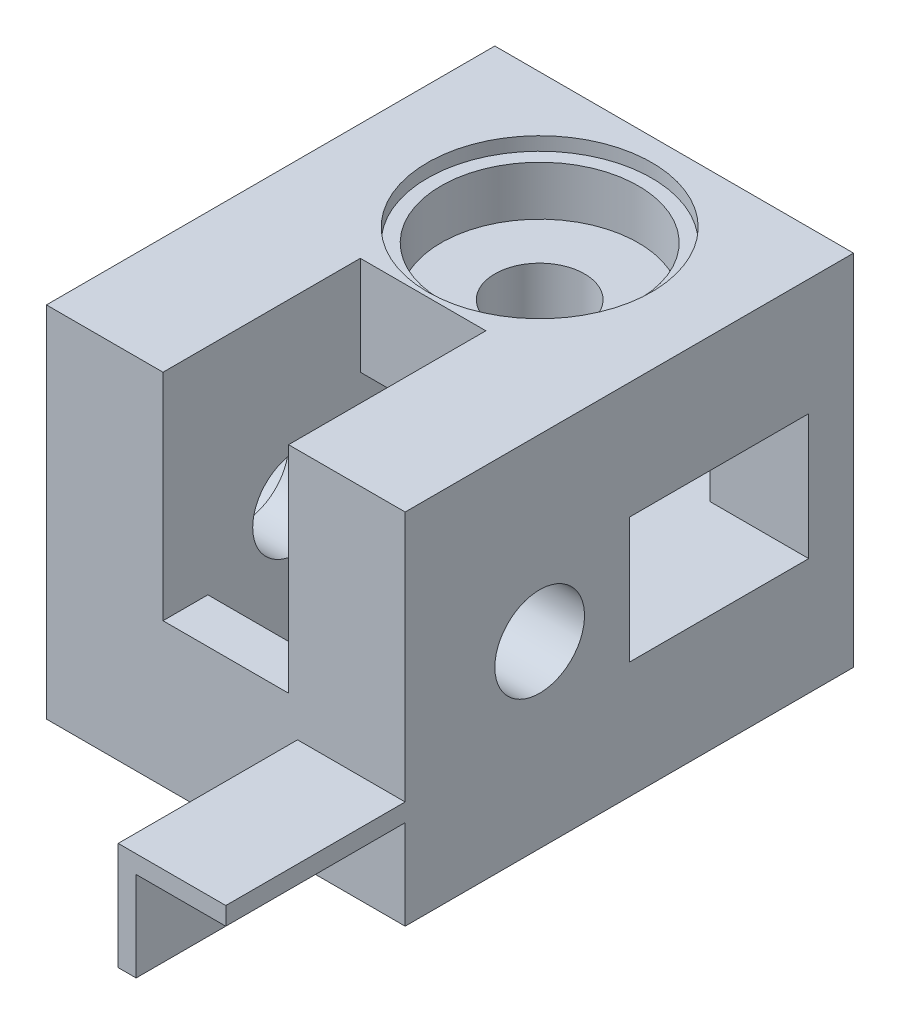
ISO-10303-21;
HEADER;
FILE_DESCRIPTION(('STEP AP214'),'2;1');
FILE_NAME('part.step','',(''),(''),'','','');
FILE_SCHEMA(('AUTOMOTIVE_DESIGN { 1 0 10303 214 1 1 1 1 }'));
ENDSEC;
DATA;
#1=APPLICATION_CONTEXT('core data for automotive mechanical design processes');
#2=APPLICATION_PROTOCOL_DEFINITION('international standard','automotive_design',2000,#1);
#3=PRODUCT_CONTEXT('',#1,'mechanical');
#4=PRODUCT('Part','Part','',(#3));
#5=PRODUCT_RELATED_PRODUCT_CATEGORY('part','',(#4));
#6=PRODUCT_DEFINITION_FORMATION('','',#4);
#7=PRODUCT_DEFINITION_CONTEXT('part definition',#1,'design');
#8=PRODUCT_DEFINITION('design','',#6,#7);
#9=PRODUCT_DEFINITION_SHAPE('','',#8);
#10=(LENGTH_UNIT() NAMED_UNIT(*) SI_UNIT(.MILLI.,.METRE.));
#11=(NAMED_UNIT(*) PLANE_ANGLE_UNIT() SI_UNIT($,.RADIAN.));
#12=(NAMED_UNIT(*) SI_UNIT($,.STERADIAN.) SOLID_ANGLE_UNIT());
#13=UNCERTAINTY_MEASURE_WITH_UNIT(LENGTH_MEASURE(1.E-05),#10,'distance_accuracy_value','');
#14=(GEOMETRIC_REPRESENTATION_CONTEXT(3) GLOBAL_UNCERTAINTY_ASSIGNED_CONTEXT((#13)) GLOBAL_UNIT_ASSIGNED_CONTEXT((#10,
#11,#12)) REPRESENTATION_CONTEXT('',''));
#15=CARTESIAN_POINT('',(0.,0.,0.));
#16=DIRECTION('',(0.,0.,1.));
#17=DIRECTION('',(1.,0.,0.));
#18=AXIS2_PLACEMENT_3D('',#15,#16,#17);
#19=CARTESIAN_POINT('',(-33.,20.,35.));
#20=DIRECTION('',(-1.,0.,0.));
#21=DIRECTION('',(0.,0.,1.));
#22=AXIS2_PLACEMENT_3D('',#19,#20,#21);
#23=CYLINDRICAL_SURFACE('',#22,11.);
#24=CARTESIAN_POINT('',(-33.,20.,35.));
#25=DIRECTION('',(-1.,0.,0.));
#26=DIRECTION('',(0.,0.,1.));
#27=AXIS2_PLACEMENT_3D('',#24,#25,#26);
#28=CIRCLE('',#27,11.);
#29=CARTESIAN_POINT('',(-33.,20.,46.));
#30=VERTEX_POINT('',#29);
#31=EDGE_CURVE('E463',#30,#30,#28,.T.);
#32=ORIENTED_EDGE('',*,*,#31,.F.);
#33=EDGE_LOOP('',(#32));
#34=FACE_BOUND('',#33,.T.);
#35=CARTESIAN_POINT('',(-38.5,20.,35.));
#36=DIRECTION('',(-1.,0.,0.));
#37=DIRECTION('',(0.,0.,1.));
#38=AXIS2_PLACEMENT_3D('',#35,#36,#37);
#39=CIRCLE('',#38,11.);
#40=CARTESIAN_POINT('',(-38.5,20.,46.));
#41=VERTEX_POINT('',#40);
#42=EDGE_CURVE('E37',#41,#41,#39,.F.);
#43=ORIENTED_EDGE('',*,*,#42,.F.);
#44=EDGE_LOOP('',(#43));
#45=FACE_BOUND('',#44,.T.);
#46=ADVANCED_FACE('F33',(#34,#45),#23,.F.);
#47=CARTESIAN_POINT('',(0.,20.,35.));
#48=DIRECTION('',(-1.,0.,0.));
#49=DIRECTION('',(0.,0.,1.));
#50=AXIS2_PLACEMENT_3D('',#47,#48,#49);
#51=CYLINDRICAL_SURFACE('',#50,5.);
#52=CARTESIAN_POINT('',(-27.,20.,35.));
#53=DIRECTION('',(-1.,0.,0.));
#54=DIRECTION('',(0.,0.,1.));
#55=AXIS2_PLACEMENT_3D('',#52,#53,#54);
#56=CIRCLE('',#55,5.);
#57=CARTESIAN_POINT('',(-27.,20.,40.));
#58=VERTEX_POINT('',#57);
#59=EDGE_CURVE('E353',#58,#58,#56,.F.);
#60=ORIENTED_EDGE('',*,*,#59,.T.);
#61=EDGE_LOOP('',(#60));
#62=FACE_BOUND('',#61,.T.);
#63=CARTESIAN_POINT('',(-33.,20.,35.));
#64=DIRECTION('',(-1.,0.,0.));
#65=DIRECTION('',(0.,0.,1.));
#66=AXIS2_PLACEMENT_3D('',#63,#64,#65);
#67=CIRCLE('',#66,5.);
#68=CARTESIAN_POINT('',(-33.,20.,40.));
#69=VERTEX_POINT('',#68);
#70=EDGE_CURVE('E460',#69,#69,#67,.F.);
#71=ORIENTED_EDGE('',*,*,#70,.F.);
#72=EDGE_LOOP('',(#71));
#73=FACE_BOUND('',#72,.T.);
#74=ADVANCED_FACE('F506',(#62,#73),#51,.F.);
#75=CARTESIAN_POINT('',(0.,0.,50.));
#76=DIRECTION('',(0.,0.,1.));
#77=DIRECTION('',(1.,0.,0.));
#78=AXIS2_PLACEMENT_3D('',#75,#76,#77);
#79=PLANE('',#78);
#80=DIRECTION('',(0.,-1.,0.));
#81=VECTOR('',#80,1.);
#82=CARTESIAN_POINT('',(-12.,12.,50.));
#83=LINE('',#82,#81);
#84=CARTESIAN_POINT('',(-12.,12.,50.));
#85=VERTEX_POINT('',#84);
#86=CARTESIAN_POINT('',(-12.,0.,50.));
#87=VERTEX_POINT('',#86);
#88=EDGE_CURVE('E50',#85,#87,#83,.T.);
#89=ORIENTED_EDGE('',*,*,#88,.F.);
#90=DIRECTION('',(-1.,0.,0.));
#91=VECTOR('',#90,1.);
#92=CARTESIAN_POINT('',(0.,12.,50.));
#93=LINE('',#92,#91);
#94=CARTESIAN_POINT('',(0.,12.,50.));
#95=VERTEX_POINT('',#94);
#96=EDGE_CURVE('E54',#95,#85,#93,.T.);
#97=ORIENTED_EDGE('',*,*,#96,.F.);
#98=DIRECTION('',(0.,1.,0.));
#99=VECTOR('',#98,1.);
#100=CARTESIAN_POINT('',(0.,40.,50.));
#101=LINE('',#100,#99);
#102=CARTESIAN_POINT('',(0.,40.,50.));
#103=VERTEX_POINT('',#102);
#104=EDGE_CURVE('E409',#95,#103,#101,.T.);
#105=ORIENTED_EDGE('',*,*,#104,.T.);
#106=DIRECTION('',(-1.,0.,0.));
#107=VECTOR('',#106,1.);
#108=CARTESIAN_POINT('',(-40.,40.,50.));
#109=LINE('',#108,#107);
#110=CARTESIAN_POINT('',(-13.,40.,50.));
#111=VERTEX_POINT('',#110);
#112=EDGE_CURVE('E439',#103,#111,#109,.T.);
#113=ORIENTED_EDGE('',*,*,#112,.T.);
#114=DIRECTION('',(0.,1.,0.));
#115=VECTOR('',#114,1.);
#116=CARTESIAN_POINT('',(-13.,16.,50.));
#117=LINE('',#116,#115);
#118=CARTESIAN_POINT('',(-13.,16.,50.));
#119=VERTEX_POINT('',#118);
#120=EDGE_CURVE('E292',#119,#111,#117,.T.);
#121=ORIENTED_EDGE('',*,*,#120,.F.);
#122=DIRECTION('',(1.,0.,0.));
#123=VECTOR('',#122,1.);
#124=CARTESIAN_POINT('',(-27.,16.,50.));
#125=LINE('',#124,#123);
#126=CARTESIAN_POINT('',(-27.,16.,50.));
#127=VERTEX_POINT('',#126);
#128=EDGE_CURVE('E273',#127,#119,#125,.T.);
#129=ORIENTED_EDGE('',*,*,#128,.F.);
#130=DIRECTION('',(0.,1.,0.));
#131=VECTOR('',#130,1.);
#132=CARTESIAN_POINT('',(-27.,16.,50.));
#133=LINE('',#132,#131);
#134=CARTESIAN_POINT('',(-27.,40.,50.));
#135=VERTEX_POINT('',#134);
#136=EDGE_CURVE('E279',#127,#135,#133,.T.);
#137=ORIENTED_EDGE('',*,*,#136,.T.);
#138=CARTESIAN_POINT('',(-40.,40.,50.));
#139=VERTEX_POINT('',#138);
#140=EDGE_CURVE('E448',#135,#139,#109,.T.);
#141=ORIENTED_EDGE('',*,*,#140,.T.);
#142=DIRECTION('',(0.,-1.,0.));
#143=VECTOR('',#142,1.);
#144=CARTESIAN_POINT('',(-40.,40.,50.));
#145=LINE('',#144,#143);
#146=CARTESIAN_POINT('',(-40.,0.,50.));
#147=VERTEX_POINT('',#146);
#148=EDGE_CURVE('E395',#139,#147,#145,.T.);
#149=ORIENTED_EDGE('',*,*,#148,.T.);
#150=DIRECTION('',(1.,0.,0.));
#151=VECTOR('',#150,1.);
#152=CARTESIAN_POINT('',(-40.,0.,50.));
#153=LINE('',#152,#151);
#154=EDGE_CURVE('E407',#147,#87,#153,.T.);
#155=ORIENTED_EDGE('',*,*,#154,.T.);
#156=EDGE_LOOP('',(#89,#97,#105,#113,#121,#129,#137,#141,#149,#155));
#157=FACE_BOUND('',#156,.T.);
#158=ADVANCED_FACE('F513',(#157),#79,.T.);
#159=CARTESIAN_POINT('',(-20.,33.,15.));
#160=DIRECTION('',(0.,1.,0.));
#161=DIRECTION('',(0.,0.,1.));
#162=AXIS2_PLACEMENT_3D('',#159,#160,#161);
#163=CYLINDRICAL_SURFACE('',#162,11.);
#164=CARTESIAN_POINT('',(-20.,33.,15.));
#165=DIRECTION('',(0.,1.,0.));
#166=DIRECTION('',(0.,0.,1.));
#167=AXIS2_PLACEMENT_3D('',#164,#165,#166);
#168=CIRCLE('',#167,11.);
#169=CARTESIAN_POINT('',(-20.,33.,26.));
#170=VERTEX_POINT('',#169);
#171=EDGE_CURVE('E266',#170,#170,#168,.T.);
#172=ORIENTED_EDGE('',*,*,#171,.F.);
#173=EDGE_LOOP('',(#172));
#174=FACE_BOUND('',#173,.T.);
#175=CARTESIAN_POINT('',(-20.,38.5,15.));
#176=DIRECTION('',(0.,1.,0.));
#177=DIRECTION('',(0.,0.,1.));
#178=AXIS2_PLACEMENT_3D('',#175,#176,#177);
#179=CIRCLE('',#178,11.);
#180=CARTESIAN_POINT('',(-20.,38.5,26.));
#181=VERTEX_POINT('',#180);
#182=EDGE_CURVE('E264',#181,#181,#179,.F.);
#183=ORIENTED_EDGE('',*,*,#182,.F.);
#184=EDGE_LOOP('',(#183));
#185=FACE_BOUND('',#184,.T.);
#186=ADVANCED_FACE('F547',(#174,#185),#163,.F.);
#187=CARTESIAN_POINT('',(-20.,0.,15.));
#188=DIRECTION('',(0.,1.,0.));
#189=DIRECTION('',(0.,0.,1.));
#190=AXIS2_PLACEMENT_3D('',#187,#188,#189);
#191=CYLINDRICAL_SURFACE('',#190,5.);
#192=CARTESIAN_POINT('',(-20.,27.,15.));
#193=DIRECTION('',(0.,1.,0.));
#194=DIRECTION('',(0.,0.,1.));
#195=AXIS2_PLACEMENT_3D('',#192,#193,#194);
#196=CIRCLE('',#195,5.);
#197=CARTESIAN_POINT('',(-20.,27.,20.));
#198=VERTEX_POINT('',#197);
#199=EDGE_CURVE('E380',#198,#198,#196,.F.);
#200=ORIENTED_EDGE('',*,*,#199,.T.);
#201=EDGE_LOOP('',(#200));
#202=FACE_BOUND('',#201,.T.);
#203=CARTESIAN_POINT('',(-20.,33.,15.));
#204=DIRECTION('',(0.,1.,0.));
#205=DIRECTION('',(0.,0.,1.));
#206=AXIS2_PLACEMENT_3D('',#203,#204,#205);
#207=CIRCLE('',#206,5.);
#208=CARTESIAN_POINT('',(-20.,33.,20.));
#209=VERTEX_POINT('',#208);
#210=EDGE_CURVE('E269',#209,#209,#207,.F.);
#211=ORIENTED_EDGE('',*,*,#210,.F.);
#212=EDGE_LOOP('',(#211));
#213=FACE_BOUND('',#212,.T.);
#214=ADVANCED_FACE('F550',(#202,#213),#191,.F.);
#215=CARTESIAN_POINT('',(-13.,20.,35.));
#216=DIRECTION('',(1.,0.,0.));
#217=DIRECTION('',(0.,0.,-1.));
#218=AXIS2_PLACEMENT_3D('',#215,#216,#217);
#219=CIRCLE('',#218,5.);
#220=CARTESIAN_POINT('',(-13.,20.,30.));
#221=VERTEX_POINT('',#220);
#222=EDGE_CURVE('E374',#221,#221,#219,.F.);
#223=ORIENTED_EDGE('',*,*,#222,.T.);
#224=EDGE_LOOP('',(#223));
#225=FACE_BOUND('',#224,.T.);
#226=CARTESIAN_POINT('',(0.,20.,35.));
#227=DIRECTION('',(-1.,0.,0.));
#228=DIRECTION('',(0.,0.,1.));
#229=AXIS2_PLACEMENT_3D('',#226,#227,#228);
#230=CIRCLE('',#229,5.);
#231=CARTESIAN_POINT('',(0.,20.,40.));
#232=VERTEX_POINT('',#231);
#233=EDGE_CURVE('E387',#232,#232,#230,.T.);
#234=ORIENTED_EDGE('',*,*,#233,.F.);
#235=EDGE_LOOP('',(#234));
#236=FACE_BOUND('',#235,.T.);
#237=ADVANCED_FACE('F516',(#225,#236),#51,.F.);
#238=CARTESIAN_POINT('',(-20.,13.,15.));
#239=DIRECTION('',(0.,-1.,0.));
#240=DIRECTION('',(0.,0.,-1.));
#241=AXIS2_PLACEMENT_3D('',#238,#239,#240);
#242=CIRCLE('',#241,5.);
#243=CARTESIAN_POINT('',(-20.,13.,10.));
#244=VERTEX_POINT('',#243);
#245=EDGE_CURVE('E391',#244,#244,#242,.F.);
#246=ORIENTED_EDGE('',*,*,#245,.T.);
#247=EDGE_LOOP('',(#246));
#248=FACE_BOUND('',#247,.T.);
#249=CARTESIAN_POINT('',(-20.,0.,15.));
#250=DIRECTION('',(0.,1.,0.));
#251=DIRECTION('',(0.,0.,1.));
#252=AXIS2_PLACEMENT_3D('',#249,#250,#251);
#253=CIRCLE('',#252,5.);
#254=CARTESIAN_POINT('',(-20.,0.,20.));
#255=VERTEX_POINT('',#254);
#256=EDGE_CURVE('E390',#255,#255,#253,.T.);
#257=ORIENTED_EDGE('',*,*,#256,.F.);
#258=EDGE_LOOP('',(#257));
#259=FACE_BOUND('',#258,.T.);
#260=ADVANCED_FACE('F611',(#248,#259),#191,.F.);
#261=CARTESIAN_POINT('',(-40.,40.,50.));
#262=DIRECTION('',(1.,0.,0.));
#263=DIRECTION('',(0.,0.,-1.));
#264=AXIS2_PLACEMENT_3D('',#261,#262,#263);
#265=PLANE('',#264);
#266=CARTESIAN_POINT('',(-40.,20.,35.));
#267=DIRECTION('',(-1.,0.,0.));
#268=DIRECTION('',(0.,0.,1.));
#269=AXIS2_PLACEMENT_3D('',#266,#267,#268);
#270=CIRCLE('',#269,12.5);
#271=CARTESIAN_POINT('',(-40.,20.,47.5));
#272=VERTEX_POINT('',#271);
#273=EDGE_CURVE('E493',#272,#272,#270,.T.);
#274=ORIENTED_EDGE('',*,*,#273,.F.);
#275=EDGE_LOOP('',(#274));
#276=FACE_BOUND('',#275,.T.);
#277=DIRECTION('',(0.,1.,0.));
#278=VECTOR('',#277,1.);
#279=CARTESIAN_POINT('',(-40.,27.,22.));
#280=LINE('',#279,#278);
#281=CARTESIAN_POINT('',(-40.,13.,22.));
#282=VERTEX_POINT('',#281);
#283=CARTESIAN_POINT('',(-40.,27.,22.));
#284=VERTEX_POINT('',#283);
#285=EDGE_CURVE('E370',#282,#284,#280,.T.);
#286=ORIENTED_EDGE('',*,*,#285,.F.);
#287=DIRECTION('',(0.,0.,1.));
#288=VECTOR('',#287,1.);
#289=CARTESIAN_POINT('',(-40.,13.,22.));
#290=LINE('',#289,#288);
#291=CARTESIAN_POINT('',(-40.,13.,0.));
#292=VERTEX_POINT('',#291);
#293=EDGE_CURVE('E364',#292,#282,#290,.T.);
#294=ORIENTED_EDGE('',*,*,#293,.F.);
#295=DIRECTION('',(0.,-1.,0.));
#296=VECTOR('',#295,1.);
#297=CARTESIAN_POINT('',(-40.,40.,0.));
#298=LINE('',#297,#296);
#299=CARTESIAN_POINT('',(-40.,0.,0.));
#300=VERTEX_POINT('',#299);
#301=EDGE_CURVE('E394',#292,#300,#298,.T.);
#302=ORIENTED_EDGE('',*,*,#301,.T.);
#303=DIRECTION('',(0.,0.,-1.));
#304=VECTOR('',#303,1.);
#305=CARTESIAN_POINT('',(-40.,0.,50.));
#306=LINE('',#305,#304);
#307=EDGE_CURVE('E419',#147,#300,#306,.T.);
#308=ORIENTED_EDGE('',*,*,#307,.F.);
#309=ORIENTED_EDGE('',*,*,#148,.F.);
#310=DIRECTION('',(0.,0.,-1.));
#311=VECTOR('',#310,1.);
#312=CARTESIAN_POINT('',(-40.,40.,50.));
#313=LINE('',#312,#311);
#314=CARTESIAN_POINT('',(-40.,40.,0.));
#315=VERTEX_POINT('',#314);
#316=EDGE_CURVE('E436',#139,#315,#313,.T.);
#317=ORIENTED_EDGE('',*,*,#316,.T.);
#318=CARTESIAN_POINT('',(-40.,27.,0.));
#319=VERTEX_POINT('',#318);
#320=EDGE_CURVE('E445',#315,#319,#298,.T.);
#321=ORIENTED_EDGE('',*,*,#320,.T.);
#322=DIRECTION('',(0.,0.,-1.));
#323=VECTOR('',#322,1.);
#324=CARTESIAN_POINT('',(-40.,27.,22.));
#325=LINE('',#324,#323);
#326=EDGE_CURVE('E373',#284,#319,#325,.T.);
#327=ORIENTED_EDGE('',*,*,#326,.F.);
#328=EDGE_LOOP('',(#286,#294,#302,#308,#309,#317,#321,#327));
#329=FACE_BOUND('',#328,.T.);
#330=ADVANCED_FACE('F35',(#276,#329),#265,.F.);
#331=CARTESIAN_POINT('',(-40.,0.,50.));
#332=DIRECTION('',(0.,1.,0.));
#333=DIRECTION('',(0.,0.,1.));
#334=AXIS2_PLACEMENT_3D('',#331,#332,#333);
#335=PLANE('',#334);
#336=DIRECTION('',(-1.,0.,0.));
#337=VECTOR('',#336,1.);
#338=CARTESIAN_POINT('',(-13.,0.,45.));
#339=LINE('',#338,#337);
#340=CARTESIAN_POINT('',(-13.,0.,45.));
#341=VERTEX_POINT('',#340);
#342=CARTESIAN_POINT('',(-27.,0.,45.));
#343=VERTEX_POINT('',#342);
#344=EDGE_CURVE('E342',#341,#343,#339,.T.);
#345=ORIENTED_EDGE('',*,*,#344,.F.);
#346=DIRECTION('',(0.,0.,1.));
#347=VECTOR('',#346,1.);
#348=CARTESIAN_POINT('',(-13.,0.,25.));
#349=LINE('',#348,#347);
#350=CARTESIAN_POINT('',(-13.,0.,25.));
#351=VERTEX_POINT('',#350);
#352=EDGE_CURVE('E329',#351,#341,#349,.T.);
#353=ORIENTED_EDGE('',*,*,#352,.F.);
#354=DIRECTION('',(1.,0.,0.));
#355=VECTOR('',#354,1.);
#356=CARTESIAN_POINT('',(-13.,0.,25.));
#357=LINE('',#356,#355);
#358=CARTESIAN_POINT('',(-27.,0.,25.));
#359=VERTEX_POINT('',#358);
#360=EDGE_CURVE('E334',#359,#351,#357,.T.);
#361=ORIENTED_EDGE('',*,*,#360,.F.);
#362=DIRECTION('',(0.,0.,-1.));
#363=VECTOR('',#362,1.);
#364=CARTESIAN_POINT('',(-27.,0.,25.));
#365=LINE('',#364,#363);
#366=EDGE_CURVE('E345',#343,#359,#365,.T.);
#367=ORIENTED_EDGE('',*,*,#366,.F.);
#368=EDGE_LOOP('',(#345,#353,#361,#367));
#369=FACE_BOUND('',#368,.T.);
#370=ORIENTED_EDGE('',*,*,#256,.T.);
#371=EDGE_LOOP('',(#370));
#372=FACE_BOUND('',#371,.T.);
#373=DIRECTION('',(1.,0.,0.));
#374=VECTOR('',#373,1.);
#375=CARTESIAN_POINT('',(-40.,0.,0.));
#376=LINE('',#375,#374);
#377=CARTESIAN_POINT('',(0.,0.,0.));
#378=VERTEX_POINT('',#377);
#379=EDGE_CURVE('E443',#300,#378,#376,.T.);
#380=ORIENTED_EDGE('',*,*,#379,.T.);
#381=DIRECTION('',(0.,0.,-1.));
#382=VECTOR('',#381,1.);
#383=CARTESIAN_POINT('',(0.,0.,50.));
#384=LINE('',#383,#382);
#385=CARTESIAN_POINT('',(0.,0.,50.));
#386=VERTEX_POINT('',#385);
#387=EDGE_CURVE('E430',#386,#378,#384,.T.);
#388=ORIENTED_EDGE('',*,*,#387,.F.);
#389=CARTESIAN_POINT('',(-10.,0.,50.));
#390=VERTEX_POINT('',#389);
#391=EDGE_CURVE('E236',#390,#386,#153,.T.);
#392=ORIENTED_EDGE('',*,*,#391,.F.);
#393=DIRECTION('',(0.,0.,-1.));
#394=VECTOR('',#393,1.);
#395=CARTESIAN_POINT('',(-10.,0.,70.));
#396=LINE('',#395,#394);
#397=CARTESIAN_POINT('',(-10.,0.,70.));
#398=VERTEX_POINT('',#397);
#399=EDGE_CURVE('E217',#398,#390,#396,.T.);
#400=ORIENTED_EDGE('',*,*,#399,.F.);
#401=DIRECTION('',(1.,0.,0.));
#402=VECTOR('',#401,1.);
#403=CARTESIAN_POINT('',(-12.,0.,70.));
#404=LINE('',#403,#402);
#405=CARTESIAN_POINT('',(-12.,0.,70.));
#406=VERTEX_POINT('',#405);
#407=EDGE_CURVE('E223',#406,#398,#404,.T.);
#408=ORIENTED_EDGE('',*,*,#407,.F.);
#409=DIRECTION('',(0.,0.,-1.));
#410=VECTOR('',#409,1.);
#411=CARTESIAN_POINT('',(-12.,0.,70.));
#412=LINE('',#411,#410);
#413=EDGE_CURVE('E252',#406,#87,#412,.T.);
#414=ORIENTED_EDGE('',*,*,#413,.T.);
#415=ORIENTED_EDGE('',*,*,#154,.F.);
#416=ORIENTED_EDGE('',*,*,#307,.T.);
#417=EDGE_LOOP('',(#380,#388,#392,#400,#408,#414,#415,#416));
#418=FACE_BOUND('',#417,.T.);
#419=ADVANCED_FACE('F234',(#369,#372,#418),#335,.F.);
#420=CARTESIAN_POINT('',(0.,40.,50.));
#421=DIRECTION('',(-1.,0.,0.));
#422=DIRECTION('',(0.,-1.,0.));
#423=AXIS2_PLACEMENT_3D('',#420,#421,#422);
#424=PLANE('',#423);
#425=DIRECTION('',(0.,0.,-1.));
#426=VECTOR('',#425,1.);
#427=CARTESIAN_POINT('',(0.,13.,5.));
#428=LINE('',#427,#426);
#429=CARTESIAN_POINT('',(0.,13.,25.));
#430=VERTEX_POINT('',#429);
#431=CARTESIAN_POINT('',(0.,13.,5.));
#432=VERTEX_POINT('',#431);
#433=EDGE_CURVE('E307',#430,#432,#428,.T.);
#434=ORIENTED_EDGE('',*,*,#433,.F.);
#435=DIRECTION('',(0.,-1.,0.));
#436=VECTOR('',#435,1.);
#437=CARTESIAN_POINT('',(0.,27.,25.));
#438=LINE('',#437,#436);
#439=CARTESIAN_POINT('',(0.,27.,25.));
#440=VERTEX_POINT('',#439);
#441=EDGE_CURVE('E289',#440,#430,#438,.T.);
#442=ORIENTED_EDGE('',*,*,#441,.F.);
#443=DIRECTION('',(0.,0.,1.));
#444=VECTOR('',#443,1.);
#445=CARTESIAN_POINT('',(0.,27.,5.));
#446=LINE('',#445,#444);
#447=CARTESIAN_POINT('',(0.,27.,5.));
#448=VERTEX_POINT('',#447);
#449=EDGE_CURVE('E300',#448,#440,#446,.T.);
#450=ORIENTED_EDGE('',*,*,#449,.F.);
#451=DIRECTION('',(0.,1.,0.));
#452=VECTOR('',#451,1.);
#453=CARTESIAN_POINT('',(0.,27.,5.));
#454=LINE('',#453,#452);
#455=EDGE_CURVE('E310',#432,#448,#454,.T.);
#456=ORIENTED_EDGE('',*,*,#455,.F.);
#457=EDGE_LOOP('',(#434,#442,#450,#456));
#458=FACE_BOUND('',#457,.T.);
#459=ORIENTED_EDGE('',*,*,#233,.T.);
#460=EDGE_LOOP('',(#459));
#461=FACE_BOUND('',#460,.T.);
#462=DIRECTION('',(0.,1.,0.));
#463=VECTOR('',#462,1.);
#464=CARTESIAN_POINT('',(0.,40.,0.));
#465=LINE('',#464,#463);
#466=CARTESIAN_POINT('',(0.,40.,0.));
#467=VERTEX_POINT('',#466);
#468=EDGE_CURVE('E441',#378,#467,#465,.T.);
#469=ORIENTED_EDGE('',*,*,#468,.T.);
#470=DIRECTION('',(0.,0.,-1.));
#471=VECTOR('',#470,1.);
#472=CARTESIAN_POINT('',(0.,40.,50.));
#473=LINE('',#472,#471);
#474=EDGE_CURVE('E433',#103,#467,#473,.T.);
#475=ORIENTED_EDGE('',*,*,#474,.F.);
#476=ORIENTED_EDGE('',*,*,#104,.F.);
#477=DIRECTION('',(0.,0.,-1.));
#478=VECTOR('',#477,1.);
#479=CARTESIAN_POINT('',(0.,12.,70.));
#480=LINE('',#479,#478);
#481=CARTESIAN_POINT('',(0.,12.,70.));
#482=VERTEX_POINT('',#481);
#483=EDGE_CURVE('E261',#482,#95,#480,.T.);
#484=ORIENTED_EDGE('',*,*,#483,.F.);
#485=DIRECTION('',(0.,1.,0.));
#486=VECTOR('',#485,1.);
#487=CARTESIAN_POINT('',(0.,10.,70.));
#488=LINE('',#487,#486);
#489=CARTESIAN_POINT('',(0.,10.,70.));
#490=VERTEX_POINT('',#489);
#491=EDGE_CURVE('E488',#490,#482,#488,.T.);
#492=ORIENTED_EDGE('',*,*,#491,.F.);
#493=DIRECTION('',(0.,0.,-1.));
#494=VECTOR('',#493,1.);
#495=CARTESIAN_POINT('',(0.,10.,70.));
#496=LINE('',#495,#494);
#497=CARTESIAN_POINT('',(0.,10.,50.));
#498=VERTEX_POINT('',#497);
#499=EDGE_CURVE('E242',#490,#498,#496,.T.);
#500=ORIENTED_EDGE('',*,*,#499,.T.);
#501=EDGE_CURVE('E451',#386,#498,#101,.T.);
#502=ORIENTED_EDGE('',*,*,#501,.F.);
#503=ORIENTED_EDGE('',*,*,#387,.T.);
#504=EDGE_LOOP('',(#469,#475,#476,#484,#492,#500,#502,#503));
#505=FACE_BOUND('',#504,.T.);
#506=ADVANCED_FACE('F621',(#458,#461,#505),#424,.F.);
#507=CARTESIAN_POINT('',(-40.,40.,50.));
#508=DIRECTION('',(0.,-1.,0.));
#509=DIRECTION('',(0.,0.,-1.));
#510=AXIS2_PLACEMENT_3D('',#507,#508,#509);
#511=PLANE('',#510);
#512=CARTESIAN_POINT('',(-20.,40.,15.));
#513=DIRECTION('',(0.,1.,0.));
#514=DIRECTION('',(0.,0.,1.));
#515=AXIS2_PLACEMENT_3D('',#512,#513,#514);
#516=CIRCLE('',#515,12.5);
#517=CARTESIAN_POINT('',(-20.,40.,27.5));
#518=VERTEX_POINT('',#517);
#519=EDGE_CURVE('E237',#518,#518,#516,.T.);
#520=ORIENTED_EDGE('',*,*,#519,.F.);
#521=EDGE_LOOP('',(#520));
#522=FACE_BOUND('',#521,.T.);
#523=ORIENTED_EDGE('',*,*,#140,.F.);
#524=DIRECTION('',(0.,0.,1.));
#525=VECTOR('',#524,1.);
#526=CARTESIAN_POINT('',(-27.,40.,50.));
#527=LINE('',#526,#525);
#528=CARTESIAN_POINT('',(-27.,40.,28.));
#529=VERTEX_POINT('',#528);
#530=EDGE_CURVE('E280',#529,#135,#527,.T.);
#531=ORIENTED_EDGE('',*,*,#530,.F.);
#532=DIRECTION('',(-1.,0.,0.));
#533=VECTOR('',#532,1.);
#534=CARTESIAN_POINT('',(-27.,40.,28.));
#535=LINE('',#534,#533);
#536=CARTESIAN_POINT('',(-13.,40.,28.));
#537=VERTEX_POINT('',#536);
#538=EDGE_CURVE('E274',#537,#529,#535,.T.);
#539=ORIENTED_EDGE('',*,*,#538,.F.);
#540=DIRECTION('',(0.,0.,-1.));
#541=VECTOR('',#540,1.);
#542=CARTESIAN_POINT('',(-13.,40.,50.));
#543=LINE('',#542,#541);
#544=EDGE_CURVE('E282',#111,#537,#543,.T.);
#545=ORIENTED_EDGE('',*,*,#544,.F.);
#546=ORIENTED_EDGE('',*,*,#112,.F.);
#547=ORIENTED_EDGE('',*,*,#474,.T.);
#548=DIRECTION('',(-1.,0.,0.));
#549=VECTOR('',#548,1.);
#550=CARTESIAN_POINT('',(-40.,40.,0.));
#551=LINE('',#550,#549);
#552=EDGE_CURVE('E398',#467,#315,#551,.T.);
#553=ORIENTED_EDGE('',*,*,#552,.T.);
#554=ORIENTED_EDGE('',*,*,#316,.F.);
#555=EDGE_LOOP('',(#523,#531,#539,#545,#546,#547,#553,#554));
#556=FACE_BOUND('',#555,.T.);
#557=ADVANCED_FACE('F615',(#522,#556),#511,.F.);
#558=DIRECTION('',(1.,0.,0.));
#559=VECTOR('',#558,1.);
#560=CARTESIAN_POINT('',(-10.,10.,50.));
#561=LINE('',#560,#559);
#562=CARTESIAN_POINT('',(-10.,10.,50.));
#563=VERTEX_POINT('',#562);
#564=EDGE_CURVE('E459',#563,#498,#561,.T.);
#565=ORIENTED_EDGE('',*,*,#564,.F.);
#566=DIRECTION('',(0.,1.,0.));
#567=VECTOR('',#566,1.);
#568=CARTESIAN_POINT('',(-10.,0.,50.));
#569=LINE('',#568,#567);
#570=EDGE_CURVE('E458',#390,#563,#569,.T.);
#571=ORIENTED_EDGE('',*,*,#570,.F.);
#572=ORIENTED_EDGE('',*,*,#391,.T.);
#573=ORIENTED_EDGE('',*,*,#501,.T.);
#574=EDGE_LOOP('',(#565,#571,#572,#573));
#575=FACE_BOUND('',#574,.T.);
#576=ADVANCED_FACE('F612',(#575),#79,.T.);
#577=CARTESIAN_POINT('',(0.,0.,0.));
#578=DIRECTION('',(0.,0.,1.));
#579=DIRECTION('',(1.,0.,0.));
#580=AXIS2_PLACEMENT_3D('',#577,#578,#579);
#581=PLANE('',#580);
#582=ORIENTED_EDGE('',*,*,#301,.F.);
#583=DIRECTION('',(-1.,0.,0.));
#584=VECTOR('',#583,1.);
#585=CARTESIAN_POINT('',(-11.,13.,0.));
#586=LINE('',#585,#584);
#587=CARTESIAN_POINT('',(-11.,13.,0.));
#588=VERTEX_POINT('',#587);
#589=EDGE_CURVE('E381',#588,#292,#586,.T.);
#590=ORIENTED_EDGE('',*,*,#589,.F.);
#591=DIRECTION('',(0.,-1.,0.));
#592=VECTOR('',#591,1.);
#593=CARTESIAN_POINT('',(-11.,27.,0.));
#594=LINE('',#593,#592);
#595=CARTESIAN_POINT('',(-11.,27.,0.));
#596=VERTEX_POINT('',#595);
#597=EDGE_CURVE('E363',#596,#588,#594,.T.);
#598=ORIENTED_EDGE('',*,*,#597,.F.);
#599=DIRECTION('',(-1.,0.,0.));
#600=VECTOR('',#599,1.);
#601=CARTESIAN_POINT('',(-11.,27.,0.));
#602=LINE('',#601,#600);
#603=EDGE_CURVE('E383',#596,#319,#602,.T.);
#604=ORIENTED_EDGE('',*,*,#603,.T.);
#605=ORIENTED_EDGE('',*,*,#320,.F.);
#606=ORIENTED_EDGE('',*,*,#552,.F.);
#607=ORIENTED_EDGE('',*,*,#468,.F.);
#608=ORIENTED_EDGE('',*,*,#379,.F.);
#609=EDGE_LOOP('',(#582,#590,#598,#604,#605,#606,#607,#608));
#610=FACE_BOUND('',#609,.T.);
#611=ADVANCED_FACE('F600',(#610),#581,.F.);
#612=CARTESIAN_POINT('',(-11.,13.,22.));
#613=DIRECTION('',(0.,-1.,0.));
#614=DIRECTION('',(0.,0.,-1.));
#615=AXIS2_PLACEMENT_3D('',#612,#613,#614);
#616=PLANE('',#615);
#617=DIRECTION('',(1.,0.,0.));
#618=VECTOR('',#617,1.);
#619=CARTESIAN_POINT('',(-24.,13.,5.));
#620=LINE('',#619,#618);
#621=CARTESIAN_POINT('',(-11.,13.,5.));
#622=VERTEX_POINT('',#621);
#623=EDGE_CURVE('E322',#622,#432,#620,.T.);
#624=ORIENTED_EDGE('',*,*,#623,.F.);
#625=DIRECTION('',(0.,0.,1.));
#626=VECTOR('',#625,1.);
#627=CARTESIAN_POINT('',(-11.,13.,22.));
#628=LINE('',#627,#626);
#629=EDGE_CURVE('E366',#588,#622,#628,.T.);
#630=ORIENTED_EDGE('',*,*,#629,.F.);
#631=ORIENTED_EDGE('',*,*,#589,.T.);
#632=ORIENTED_EDGE('',*,*,#293,.T.);
#633=DIRECTION('',(-1.,0.,0.));
#634=VECTOR('',#633,1.);
#635=CARTESIAN_POINT('',(-11.,13.,22.));
#636=LINE('',#635,#634);
#637=CARTESIAN_POINT('',(-24.,13.,22.));
#638=VERTEX_POINT('',#637);
#639=EDGE_CURVE('E378',#638,#282,#636,.T.);
#640=ORIENTED_EDGE('',*,*,#639,.F.);
#641=DIRECTION('',(0.,0.,-1.));
#642=VECTOR('',#641,1.);
#643=CARTESIAN_POINT('',(-24.,13.,5.));
#644=LINE('',#643,#642);
#645=CARTESIAN_POINT('',(-24.,13.,25.));
#646=VERTEX_POINT('',#645);
#647=EDGE_CURVE('E299',#646,#638,#644,.T.);
#648=ORIENTED_EDGE('',*,*,#647,.F.);
#649=DIRECTION('',(1.,0.,0.));
#650=VECTOR('',#649,1.);
#651=CARTESIAN_POINT('',(-24.,13.,25.));
#652=LINE('',#651,#650);
#653=CARTESIAN_POINT('',(-13.,13.,25.));
#654=VERTEX_POINT('',#653);
#655=EDGE_CURVE('E324',#646,#654,#652,.T.);
#656=ORIENTED_EDGE('',*,*,#655,.T.);
#657=EDGE_CURVE('E305',#654,#430,#652,.T.);
#658=ORIENTED_EDGE('',*,*,#657,.T.);
#659=ORIENTED_EDGE('',*,*,#433,.T.);
#660=EDGE_LOOP('',(#624,#630,#631,#632,#640,#648,#656,#658,#659));
#661=FACE_BOUND('',#660,.T.);
#662=ORIENTED_EDGE('',*,*,#245,.F.);
#663=EDGE_LOOP('',(#662));
#664=FACE_BOUND('',#663,.T.);
#665=ADVANCED_FACE('F596',(#661,#664),#616,.F.);
#666=CARTESIAN_POINT('',(-11.,27.,22.));
#667=DIRECTION('',(0.,1.,0.));
#668=DIRECTION('',(0.,0.,1.));
#669=AXIS2_PLACEMENT_3D('',#666,#667,#668);
#670=PLANE('',#669);
#671=ORIENTED_EDGE('',*,*,#199,.F.);
#672=EDGE_LOOP('',(#671));
#673=FACE_BOUND('',#672,.T.);
#674=DIRECTION('',(0.,0.,-1.));
#675=VECTOR('',#674,1.);
#676=CARTESIAN_POINT('',(-11.,27.,22.));
#677=LINE('',#676,#675);
#678=CARTESIAN_POINT('',(-11.,27.,5.));
#679=VERTEX_POINT('',#678);
#680=EDGE_CURVE('E361',#679,#596,#677,.T.);
#681=ORIENTED_EDGE('',*,*,#680,.F.);
#682=DIRECTION('',(1.,0.,0.));
#683=VECTOR('',#682,1.);
#684=CARTESIAN_POINT('',(-24.,27.,5.));
#685=LINE('',#684,#683);
#686=EDGE_CURVE('E320',#679,#448,#685,.T.);
#687=ORIENTED_EDGE('',*,*,#686,.T.);
#688=ORIENTED_EDGE('',*,*,#449,.T.);
#689=DIRECTION('',(1.,0.,0.));
#690=VECTOR('',#689,1.);
#691=CARTESIAN_POINT('',(-24.,27.,25.));
#692=LINE('',#691,#690);
#693=CARTESIAN_POINT('',(-13.,27.,25.));
#694=VERTEX_POINT('',#693);
#695=EDGE_CURVE('E319',#694,#440,#692,.T.);
#696=ORIENTED_EDGE('',*,*,#695,.F.);
#697=CARTESIAN_POINT('',(-24.,27.,25.));
#698=VERTEX_POINT('',#697);
#699=EDGE_CURVE('E315',#698,#694,#692,.T.);
#700=ORIENTED_EDGE('',*,*,#699,.F.);
#701=DIRECTION('',(0.,0.,1.));
#702=VECTOR('',#701,1.);
#703=CARTESIAN_POINT('',(-24.,27.,5.));
#704=LINE('',#703,#702);
#705=CARTESIAN_POINT('',(-24.,27.,22.));
#706=VERTEX_POINT('',#705);
#707=EDGE_CURVE('E302',#706,#698,#704,.T.);
#708=ORIENTED_EDGE('',*,*,#707,.F.);
#709=DIRECTION('',(-1.,0.,0.));
#710=VECTOR('',#709,1.);
#711=CARTESIAN_POINT('',(-11.,27.,22.));
#712=LINE('',#711,#710);
#713=EDGE_CURVE('E369',#706,#284,#712,.T.);
#714=ORIENTED_EDGE('',*,*,#713,.T.);
#715=ORIENTED_EDGE('',*,*,#326,.T.);
#716=ORIENTED_EDGE('',*,*,#603,.F.);
#717=EDGE_LOOP('',(#681,#687,#688,#696,#700,#708,#714,#715,#716));
#718=FACE_BOUND('',#717,.T.);
#719=ADVANCED_FACE('F599',(#673,#718),#670,.F.);
#720=CARTESIAN_POINT('',(-11.,27.,22.));
#721=DIRECTION('',(0.,0.,1.));
#722=DIRECTION('',(1.,0.,0.));
#723=AXIS2_PLACEMENT_3D('',#720,#721,#722);
#724=PLANE('',#723);
#725=ORIENTED_EDGE('',*,*,#713,.F.);
#726=DIRECTION('',(0.,-1.,0.));
#727=VECTOR('',#726,1.);
#728=CARTESIAN_POINT('',(-24.,27.,22.));
#729=LINE('',#728,#727);
#730=EDGE_CURVE('E318',#706,#638,#729,.T.);
#731=ORIENTED_EDGE('',*,*,#730,.T.);
#732=ORIENTED_EDGE('',*,*,#639,.T.);
#733=ORIENTED_EDGE('',*,*,#285,.T.);
#734=EDGE_LOOP('',(#725,#731,#732,#733));
#735=FACE_BOUND('',#734,.T.);
#736=ADVANCED_FACE('F594',(#735),#724,.F.);
#737=CARTESIAN_POINT('',(-11.,0.,0.));
#738=DIRECTION('',(1.,0.,0.));
#739=DIRECTION('',(0.,0.,-1.));
#740=AXIS2_PLACEMENT_3D('',#737,#738,#739);
#741=PLANE('',#740);
#742=ORIENTED_EDGE('',*,*,#629,.T.);
#743=DIRECTION('',(0.,1.,0.));
#744=VECTOR('',#743,1.);
#745=CARTESIAN_POINT('',(-11.,0.,5.));
#746=LINE('',#745,#744);
#747=EDGE_CURVE('E416',#622,#679,#746,.T.);
#748=ORIENTED_EDGE('',*,*,#747,.T.);
#749=ORIENTED_EDGE('',*,*,#680,.T.);
#750=ORIENTED_EDGE('',*,*,#597,.T.);
#751=EDGE_LOOP('',(#742,#748,#749,#750));
#752=FACE_BOUND('',#751,.T.);
#753=ADVANCED_FACE('F590',(#752),#741,.F.);
#754=CARTESIAN_POINT('',(-13.,29.,25.));
#755=DIRECTION('',(1.,0.,0.));
#756=DIRECTION('',(0.,0.,-1.));
#757=AXIS2_PLACEMENT_3D('',#754,#755,#756);
#758=PLANE('',#757);
#759=DIRECTION('',(0.,1.,0.));
#760=VECTOR('',#759,1.);
#761=CARTESIAN_POINT('',(-13.,16.,28.));
#762=LINE('',#761,#760);
#763=CARTESIAN_POINT('',(-13.,29.,28.));
#764=VERTEX_POINT('',#763);
#765=EDGE_CURVE('E290',#764,#537,#762,.T.);
#766=ORIENTED_EDGE('',*,*,#765,.F.);
#767=DIRECTION('',(0.,0.,1.));
#768=VECTOR('',#767,1.);
#769=CARTESIAN_POINT('',(-13.,29.,25.));
#770=LINE('',#769,#768);
#771=CARTESIAN_POINT('',(-13.,29.,25.));
#772=VERTEX_POINT('',#771);
#773=EDGE_CURVE('E330',#772,#764,#770,.T.);
#774=ORIENTED_EDGE('',*,*,#773,.F.);
#775=DIRECTION('',(0.,-1.,0.));
#776=VECTOR('',#775,1.);
#777=CARTESIAN_POINT('',(-13.,29.,25.));
#778=LINE('',#777,#776);
#779=EDGE_CURVE('E350',#772,#694,#778,.T.);
#780=ORIENTED_EDGE('',*,*,#779,.T.);
#781=EDGE_CURVE('E354',#694,#654,#778,.T.);
#782=ORIENTED_EDGE('',*,*,#781,.T.);
#783=EDGE_CURVE('E355',#654,#351,#778,.T.);
#784=ORIENTED_EDGE('',*,*,#783,.T.);
#785=ORIENTED_EDGE('',*,*,#352,.T.);
#786=DIRECTION('',(0.,-1.,0.));
#787=VECTOR('',#786,1.);
#788=CARTESIAN_POINT('',(-13.,29.,45.));
#789=LINE('',#788,#787);
#790=CARTESIAN_POINT('',(-13.,16.,45.));
#791=VERTEX_POINT('',#790);
#792=EDGE_CURVE('E339',#791,#341,#789,.T.);
#793=ORIENTED_EDGE('',*,*,#792,.F.);
#794=DIRECTION('',(0.,0.,-1.));
#795=VECTOR('',#794,1.);
#796=CARTESIAN_POINT('',(-13.,16.,50.));
#797=LINE('',#796,#795);
#798=EDGE_CURVE('E277',#119,#791,#797,.T.);
#799=ORIENTED_EDGE('',*,*,#798,.F.);
#800=ORIENTED_EDGE('',*,*,#120,.T.);
#801=ORIENTED_EDGE('',*,*,#544,.T.);
#802=EDGE_LOOP('',(#766,#774,#780,#782,#784,#785,#793,#799,#800,#801));
#803=FACE_BOUND('',#802,.T.);
#804=ORIENTED_EDGE('',*,*,#222,.F.);
#805=EDGE_LOOP('',(#804));
#806=FACE_BOUND('',#805,.T.);
#807=ADVANCED_FACE('F583',(#803,#806),#758,.F.);
#808=CARTESIAN_POINT('',(-27.,29.,25.));
#809=DIRECTION('',(-1.,0.,0.));
#810=DIRECTION('',(0.,0.,1.));
#811=AXIS2_PLACEMENT_3D('',#808,#809,#810);
#812=PLANE('',#811);
#813=ORIENTED_EDGE('',*,*,#59,.F.);
#814=EDGE_LOOP('',(#813));
#815=FACE_BOUND('',#814,.T.);
#816=DIRECTION('',(0.,0.,-1.));
#817=VECTOR('',#816,1.);
#818=CARTESIAN_POINT('',(-27.,29.,25.));
#819=LINE('',#818,#817);
#820=CARTESIAN_POINT('',(-27.,29.,28.));
#821=VERTEX_POINT('',#820);
#822=CARTESIAN_POINT('',(-27.,29.,25.));
#823=VERTEX_POINT('',#822);
#824=EDGE_CURVE('E333',#821,#823,#819,.T.);
#825=ORIENTED_EDGE('',*,*,#824,.F.);
#826=DIRECTION('',(0.,1.,0.));
#827=VECTOR('',#826,1.);
#828=CARTESIAN_POINT('',(-27.,16.,28.));
#829=LINE('',#828,#827);
#830=EDGE_CURVE('E287',#821,#529,#829,.T.);
#831=ORIENTED_EDGE('',*,*,#830,.T.);
#832=ORIENTED_EDGE('',*,*,#530,.T.);
#833=ORIENTED_EDGE('',*,*,#136,.F.);
#834=DIRECTION('',(0.,0.,1.));
#835=VECTOR('',#834,1.);
#836=CARTESIAN_POINT('',(-27.,16.,50.));
#837=LINE('',#836,#835);
#838=CARTESIAN_POINT('',(-27.,16.,45.));
#839=VERTEX_POINT('',#838);
#840=EDGE_CURVE('E270',#839,#127,#837,.T.);
#841=ORIENTED_EDGE('',*,*,#840,.F.);
#842=DIRECTION('',(0.,-1.,0.));
#843=VECTOR('',#842,1.);
#844=CARTESIAN_POINT('',(-27.,29.,45.));
#845=LINE('',#844,#843);
#846=EDGE_CURVE('E358',#839,#343,#845,.T.);
#847=ORIENTED_EDGE('',*,*,#846,.T.);
#848=ORIENTED_EDGE('',*,*,#366,.T.);
#849=DIRECTION('',(0.,-1.,0.));
#850=VECTOR('',#849,1.);
#851=CARTESIAN_POINT('',(-27.,29.,25.));
#852=LINE('',#851,#850);
#853=EDGE_CURVE('E356',#823,#359,#852,.T.);
#854=ORIENTED_EDGE('',*,*,#853,.F.);
#855=EDGE_LOOP('',(#825,#831,#832,#833,#841,#847,#848,#854));
#856=FACE_BOUND('',#855,.T.);
#857=ADVANCED_FACE('F579',(#815,#856),#812,.F.);
#858=CARTESIAN_POINT('',(-13.,29.,25.));
#859=DIRECTION('',(0.,0.,-1.));
#860=DIRECTION('',(-1.,0.,0.));
#861=AXIS2_PLACEMENT_3D('',#858,#859,#860);
#862=PLANE('',#861);
#863=DIRECTION('',(0.,-1.,0.));
#864=VECTOR('',#863,1.);
#865=CARTESIAN_POINT('',(-24.,27.,25.));
#866=LINE('',#865,#864);
#867=EDGE_CURVE('E296',#698,#646,#866,.T.);
#868=ORIENTED_EDGE('',*,*,#867,.F.);
#869=ORIENTED_EDGE('',*,*,#699,.T.);
#870=ORIENTED_EDGE('',*,*,#779,.F.);
#871=DIRECTION('',(1.,0.,0.));
#872=VECTOR('',#871,1.);
#873=CARTESIAN_POINT('',(-13.,29.,25.));
#874=LINE('',#873,#872);
#875=EDGE_CURVE('E336',#823,#772,#874,.T.);
#876=ORIENTED_EDGE('',*,*,#875,.F.);
#877=ORIENTED_EDGE('',*,*,#853,.T.);
#878=ORIENTED_EDGE('',*,*,#360,.T.);
#879=ORIENTED_EDGE('',*,*,#783,.F.);
#880=ORIENTED_EDGE('',*,*,#655,.F.);
#881=EDGE_LOOP('',(#868,#869,#870,#876,#877,#878,#879,#880));
#882=FACE_BOUND('',#881,.T.);
#883=ADVANCED_FACE('F576',(#882),#862,.F.);
#884=CARTESIAN_POINT('',(-13.,29.,45.));
#885=DIRECTION('',(0.,0.,1.));
#886=DIRECTION('',(1.,0.,0.));
#887=AXIS2_PLACEMENT_3D('',#884,#885,#886);
#888=PLANE('',#887);
#889=ORIENTED_EDGE('',*,*,#846,.F.);
#890=DIRECTION('',(1.,0.,0.));
#891=VECTOR('',#890,1.);
#892=CARTESIAN_POINT('',(-13.,16.,45.));
#893=LINE('',#892,#891);
#894=EDGE_CURVE('E11',#839,#791,#893,.T.);
#895=ORIENTED_EDGE('',*,*,#894,.T.);
#896=ORIENTED_EDGE('',*,*,#792,.T.);
#897=ORIENTED_EDGE('',*,*,#344,.T.);
#898=EDGE_LOOP('',(#889,#895,#896,#897));
#899=FACE_BOUND('',#898,.T.);
#900=ADVANCED_FACE('F574',(#899),#888,.F.);
#901=CARTESIAN_POINT('',(0.,29.,0.));
#902=DIRECTION('',(0.,-1.,0.));
#903=DIRECTION('',(0.,0.,-1.));
#904=AXIS2_PLACEMENT_3D('',#901,#902,#903);
#905=PLANE('',#904);
#906=DIRECTION('',(1.,0.,0.));
#907=VECTOR('',#906,1.);
#908=CARTESIAN_POINT('',(0.,29.,28.));
#909=LINE('',#908,#907);
#910=EDGE_CURVE('E42',#821,#764,#909,.T.);
#911=ORIENTED_EDGE('',*,*,#910,.F.);
#912=ORIENTED_EDGE('',*,*,#824,.T.);
#913=ORIENTED_EDGE('',*,*,#875,.T.);
#914=ORIENTED_EDGE('',*,*,#773,.T.);
#915=EDGE_LOOP('',(#911,#912,#913,#914));
#916=FACE_BOUND('',#915,.T.);
#917=ADVANCED_FACE('F567',(#916),#905,.T.);
#918=CARTESIAN_POINT('',(-24.,27.,5.));
#919=DIRECTION('',(0.,0.,-1.));
#920=DIRECTION('',(0.,1.,0.));
#921=AXIS2_PLACEMENT_3D('',#918,#919,#920);
#922=PLANE('',#921);
#923=ORIENTED_EDGE('',*,*,#623,.T.);
#924=ORIENTED_EDGE('',*,*,#455,.T.);
#925=ORIENTED_EDGE('',*,*,#686,.F.);
#926=ORIENTED_EDGE('',*,*,#747,.F.);
#927=EDGE_LOOP('',(#923,#924,#925,#926));
#928=FACE_BOUND('',#927,.T.);
#929=ADVANCED_FACE('F564',(#928),#922,.F.);
#930=CARTESIAN_POINT('',(-24.,27.,25.));
#931=DIRECTION('',(0.,0.,1.));
#932=DIRECTION('',(1.,0.,0.));
#933=AXIS2_PLACEMENT_3D('',#930,#931,#932);
#934=PLANE('',#933);
#935=ORIENTED_EDGE('',*,*,#695,.T.);
#936=ORIENTED_EDGE('',*,*,#441,.T.);
#937=ORIENTED_EDGE('',*,*,#657,.F.);
#938=ORIENTED_EDGE('',*,*,#781,.F.);
#939=EDGE_LOOP('',(#935,#936,#937,#938));
#940=FACE_BOUND('',#939,.T.);
#941=ADVANCED_FACE('F562',(#940),#934,.F.);
#942=CARTESIAN_POINT('',(-24.,0.,0.));
#943=DIRECTION('',(-1.,0.,0.));
#944=DIRECTION('',(0.,-1.,0.));
#945=AXIS2_PLACEMENT_3D('',#942,#943,#944);
#946=PLANE('',#945);
#947=ORIENTED_EDGE('',*,*,#707,.T.);
#948=ORIENTED_EDGE('',*,*,#867,.T.);
#949=ORIENTED_EDGE('',*,*,#647,.T.);
#950=ORIENTED_EDGE('',*,*,#730,.F.);
#951=EDGE_LOOP('',(#947,#948,#949,#950));
#952=FACE_BOUND('',#951,.T.);
#953=ADVANCED_FACE('F555',(#952),#946,.F.);
#954=CARTESIAN_POINT('',(0.,16.,0.));
#955=DIRECTION('',(0.,-1.,0.));
#956=DIRECTION('',(0.,0.,-1.));
#957=AXIS2_PLACEMENT_3D('',#954,#955,#956);
#958=PLANE('',#957);
#959=ORIENTED_EDGE('',*,*,#840,.T.);
#960=ORIENTED_EDGE('',*,*,#128,.T.);
#961=ORIENTED_EDGE('',*,*,#798,.T.);
#962=ORIENTED_EDGE('',*,*,#894,.F.);
#963=EDGE_LOOP('',(#959,#960,#961,#962));
#964=FACE_BOUND('',#963,.T.);
#965=ADVANCED_FACE('F552',(#964),#958,.F.);
#966=CARTESIAN_POINT('',(-27.,16.,28.));
#967=DIRECTION('',(0.,0.,-1.));
#968=DIRECTION('',(-1.,0.,0.));
#969=AXIS2_PLACEMENT_3D('',#966,#967,#968);
#970=PLANE('',#969);
#971=ORIENTED_EDGE('',*,*,#910,.T.);
#972=ORIENTED_EDGE('',*,*,#765,.T.);
#973=ORIENTED_EDGE('',*,*,#538,.T.);
#974=ORIENTED_EDGE('',*,*,#830,.F.);
#975=EDGE_LOOP('',(#971,#972,#973,#974));
#976=FACE_BOUND('',#975,.T.);
#977=ADVANCED_FACE('F545',(#976),#970,.F.);
#978=CARTESIAN_POINT('',(-20.,33.,15.));
#979=DIRECTION('',(0.,1.,0.));
#980=DIRECTION('',(0.,0.,1.));
#981=AXIS2_PLACEMENT_3D('',#978,#979,#980);
#982=PLANE('',#981);
#983=ORIENTED_EDGE('',*,*,#171,.T.);
#984=EDGE_LOOP('',(#983));
#985=FACE_BOUND('',#984,.T.);
#986=ORIENTED_EDGE('',*,*,#210,.T.);
#987=EDGE_LOOP('',(#986));
#988=FACE_BOUND('',#987,.T.);
#989=ADVANCED_FACE('F538',(#985,#988),#982,.T.);
#990=CARTESIAN_POINT('',(-20.,38.5,15.));
#991=DIRECTION('',(0.,1.,0.));
#992=DIRECTION('',(0.,0.,1.));
#993=AXIS2_PLACEMENT_3D('',#990,#991,#992);
#994=PLANE('',#993);
#995=CARTESIAN_POINT('',(-20.,38.5,15.));
#996=DIRECTION('',(0.,1.,0.));
#997=DIRECTION('',(0.,0.,1.));
#998=AXIS2_PLACEMENT_3D('',#995,#996,#997);
#999=CIRCLE('',#998,12.5);
#1000=CARTESIAN_POINT('',(-20.,38.5,27.5));
#1001=VERTEX_POINT('',#1000);
#1002=EDGE_CURVE('E240',#1001,#1001,#999,.T.);
#1003=ORIENTED_EDGE('',*,*,#1002,.T.);
#1004=EDGE_LOOP('',(#1003));
#1005=FACE_BOUND('',#1004,.T.);
#1006=ORIENTED_EDGE('',*,*,#182,.T.);
#1007=EDGE_LOOP('',(#1006));
#1008=FACE_BOUND('',#1007,.T.);
#1009=ADVANCED_FACE('F535',(#1005,#1008),#994,.T.);
#1010=CARTESIAN_POINT('',(-20.,38.5,15.));
#1011=DIRECTION('',(0.,1.,0.));
#1012=DIRECTION('',(0.,0.,1.));
#1013=AXIS2_PLACEMENT_3D('',#1010,#1011,#1012);
#1014=CYLINDRICAL_SURFACE('',#1013,12.5);
#1015=ORIENTED_EDGE('',*,*,#1002,.F.);
#1016=EDGE_LOOP('',(#1015));
#1017=FACE_BOUND('',#1016,.T.);
#1018=ORIENTED_EDGE('',*,*,#519,.T.);
#1019=EDGE_LOOP('',(#1018));
#1020=FACE_BOUND('',#1019,.T.);
#1021=ADVANCED_FACE('F534',(#1017,#1020),#1014,.F.);
#1022=CARTESIAN_POINT('',(-10.,0.,70.));
#1023=DIRECTION('',(-1.,0.,0.));
#1024=DIRECTION('',(0.,0.,1.));
#1025=AXIS2_PLACEMENT_3D('',#1022,#1023,#1024);
#1026=PLANE('',#1025);
#1027=ORIENTED_EDGE('',*,*,#570,.T.);
#1028=DIRECTION('',(0.,0.,-1.));
#1029=VECTOR('',#1028,1.);
#1030=CARTESIAN_POINT('',(-10.,10.,70.));
#1031=LINE('',#1030,#1029);
#1032=CARTESIAN_POINT('',(-10.,10.,70.));
#1033=VERTEX_POINT('',#1032);
#1034=EDGE_CURVE('E219',#1033,#563,#1031,.T.);
#1035=ORIENTED_EDGE('',*,*,#1034,.F.);
#1036=DIRECTION('',(0.,1.,0.));
#1037=VECTOR('',#1036,1.);
#1038=CARTESIAN_POINT('',(-10.,0.,70.));
#1039=LINE('',#1038,#1037);
#1040=EDGE_CURVE('E212',#398,#1033,#1039,.T.);
#1041=ORIENTED_EDGE('',*,*,#1040,.F.);
#1042=ORIENTED_EDGE('',*,*,#399,.T.);
#1043=EDGE_LOOP('',(#1027,#1035,#1041,#1042));
#1044=FACE_BOUND('',#1043,.T.);
#1045=ADVANCED_FACE('F215',(#1044),#1026,.F.);
#1046=CARTESIAN_POINT('',(-10.,10.,70.));
#1047=DIRECTION('',(0.,1.,0.));
#1048=DIRECTION('',(0.,0.,1.));
#1049=AXIS2_PLACEMENT_3D('',#1046,#1047,#1048);
#1050=PLANE('',#1049);
#1051=ORIENTED_EDGE('',*,*,#564,.T.);
#1052=ORIENTED_EDGE('',*,*,#499,.F.);
#1053=DIRECTION('',(1.,0.,0.));
#1054=VECTOR('',#1053,1.);
#1055=CARTESIAN_POINT('',(-10.,10.,70.));
#1056=LINE('',#1055,#1054);
#1057=EDGE_CURVE('E222',#1033,#490,#1056,.T.);
#1058=ORIENTED_EDGE('',*,*,#1057,.F.);
#1059=ORIENTED_EDGE('',*,*,#1034,.T.);
#1060=EDGE_LOOP('',(#1051,#1052,#1058,#1059));
#1061=FACE_BOUND('',#1060,.T.);
#1062=ADVANCED_FACE('F528',(#1061),#1050,.F.);
#1063=CARTESIAN_POINT('',(0.,12.,70.));
#1064=DIRECTION('',(0.,-1.,0.));
#1065=DIRECTION('',(1.,0.,0.));
#1066=AXIS2_PLACEMENT_3D('',#1063,#1064,#1065);
#1067=PLANE('',#1066);
#1068=ORIENTED_EDGE('',*,*,#96,.T.);
#1069=DIRECTION('',(0.,0.,-1.));
#1070=VECTOR('',#1069,1.);
#1071=CARTESIAN_POINT('',(-12.,12.,70.));
#1072=LINE('',#1071,#1070);
#1073=CARTESIAN_POINT('',(-12.,12.,70.));
#1074=VERTEX_POINT('',#1073);
#1075=EDGE_CURVE('E259',#1074,#85,#1072,.T.);
#1076=ORIENTED_EDGE('',*,*,#1075,.F.);
#1077=DIRECTION('',(-1.,0.,0.));
#1078=VECTOR('',#1077,1.);
#1079=CARTESIAN_POINT('',(0.,12.,70.));
#1080=LINE('',#1079,#1078);
#1081=EDGE_CURVE('E487',#482,#1074,#1080,.T.);
#1082=ORIENTED_EDGE('',*,*,#1081,.F.);
#1083=ORIENTED_EDGE('',*,*,#483,.T.);
#1084=EDGE_LOOP('',(#1068,#1076,#1082,#1083));
#1085=FACE_BOUND('',#1084,.T.);
#1086=ADVANCED_FACE('F482',(#1085),#1067,.F.);
#1087=CARTESIAN_POINT('',(-12.,12.,70.));
#1088=DIRECTION('',(1.,0.,0.));
#1089=DIRECTION('',(0.,0.,-1.));
#1090=AXIS2_PLACEMENT_3D('',#1087,#1088,#1089);
#1091=PLANE('',#1090);
#1092=ORIENTED_EDGE('',*,*,#88,.T.);
#1093=ORIENTED_EDGE('',*,*,#413,.F.);
#1094=DIRECTION('',(0.,-1.,0.));
#1095=VECTOR('',#1094,1.);
#1096=CARTESIAN_POINT('',(-12.,12.,70.));
#1097=LINE('',#1096,#1095);
#1098=EDGE_CURVE('E228',#1074,#406,#1097,.T.);
#1099=ORIENTED_EDGE('',*,*,#1098,.F.);
#1100=ORIENTED_EDGE('',*,*,#1075,.T.);
#1101=EDGE_LOOP('',(#1092,#1093,#1099,#1100));
#1102=FACE_BOUND('',#1101,.T.);
#1103=ADVANCED_FACE('F486',(#1102),#1091,.F.);
#1104=CARTESIAN_POINT('',(0.,0.,70.));
#1105=DIRECTION('',(0.,0.,1.));
#1106=DIRECTION('',(1.,0.,0.));
#1107=AXIS2_PLACEMENT_3D('',#1104,#1105,#1106);
#1108=PLANE('',#1107);
#1109=ORIENTED_EDGE('',*,*,#407,.T.);
#1110=ORIENTED_EDGE('',*,*,#1040,.T.);
#1111=ORIENTED_EDGE('',*,*,#1057,.T.);
#1112=ORIENTED_EDGE('',*,*,#491,.T.);
#1113=ORIENTED_EDGE('',*,*,#1081,.T.);
#1114=ORIENTED_EDGE('',*,*,#1098,.T.);
#1115=EDGE_LOOP('',(#1109,#1110,#1111,#1112,#1113,#1114));
#1116=FACE_BOUND('',#1115,.T.);
#1117=ADVANCED_FACE('F226',(#1116),#1108,.T.);
#1118=CARTESIAN_POINT('',(-33.,20.,35.));
#1119=DIRECTION('',(-1.,0.,0.));
#1120=DIRECTION('',(0.,0.,1.));
#1121=AXIS2_PLACEMENT_3D('',#1118,#1119,#1120);
#1122=PLANE('',#1121);
#1123=ORIENTED_EDGE('',*,*,#31,.T.);
#1124=EDGE_LOOP('',(#1123));
#1125=FACE_BOUND('',#1124,.T.);
#1126=ORIENTED_EDGE('',*,*,#70,.T.);
#1127=EDGE_LOOP('',(#1126));
#1128=FACE_BOUND('',#1127,.T.);
#1129=ADVANCED_FACE('F520',(#1125,#1128),#1122,.T.);
#1130=CARTESIAN_POINT('',(-38.5,20.,35.));
#1131=DIRECTION('',(-1.,0.,0.));
#1132=DIRECTION('',(0.,0.,1.));
#1133=AXIS2_PLACEMENT_3D('',#1130,#1131,#1132);
#1134=PLANE('',#1133);
#1135=CARTESIAN_POINT('',(-38.5,20.,35.));
#1136=DIRECTION('',(-1.,0.,0.));
#1137=DIRECTION('',(0.,0.,1.));
#1138=AXIS2_PLACEMENT_3D('',#1135,#1136,#1137);
#1139=CIRCLE('',#1138,12.5);
#1140=CARTESIAN_POINT('',(-38.5,20.,47.5));
#1141=VERTEX_POINT('',#1140);
#1142=EDGE_CURVE('E496',#1141,#1141,#1139,.T.);
#1143=ORIENTED_EDGE('',*,*,#1142,.T.);
#1144=EDGE_LOOP('',(#1143));
#1145=FACE_BOUND('',#1144,.T.);
#1146=ORIENTED_EDGE('',*,*,#42,.T.);
#1147=EDGE_LOOP('',(#1146));
#1148=FACE_BOUND('',#1147,.T.);
#1149=ADVANCED_FACE('F503',(#1145,#1148),#1134,.T.);
#1150=CARTESIAN_POINT('',(-38.5,20.,35.));
#1151=DIRECTION('',(-1.,0.,0.));
#1152=DIRECTION('',(0.,0.,1.));
#1153=AXIS2_PLACEMENT_3D('',#1150,#1151,#1152);
#1154=CYLINDRICAL_SURFACE('',#1153,12.5);
#1155=ORIENTED_EDGE('',*,*,#1142,.F.);
#1156=EDGE_LOOP('',(#1155));
#1157=FACE_BOUND('',#1156,.T.);
#1158=ORIENTED_EDGE('',*,*,#273,.T.);
#1159=EDGE_LOOP('',(#1158));
#1160=FACE_BOUND('',#1159,.T.);
#1161=ADVANCED_FACE('F786',(#1157,#1160),#1154,.F.);
#1162=CLOSED_SHELL('',(#46,#74,#158,#186,#214,#237,#260,#330,#419,#506,#557,#576,#611,#665,#719,
#736,#753,#807,#857,#883,#900,#917,#929,#941,#953,#965,#977,#989,#1009,#1021,#1045,#1062,#1086,
#1103,#1117,#1129,#1149,#1161));
#1163=MANIFOLD_SOLID_BREP('B2',#1162);
#1164=ADVANCED_BREP_SHAPE_REPRESENTATION('',(#18,#1163),#14);
#1165=SHAPE_DEFINITION_REPRESENTATION(#9,#1164);
ENDSEC;
END-ISO-10303-21;
